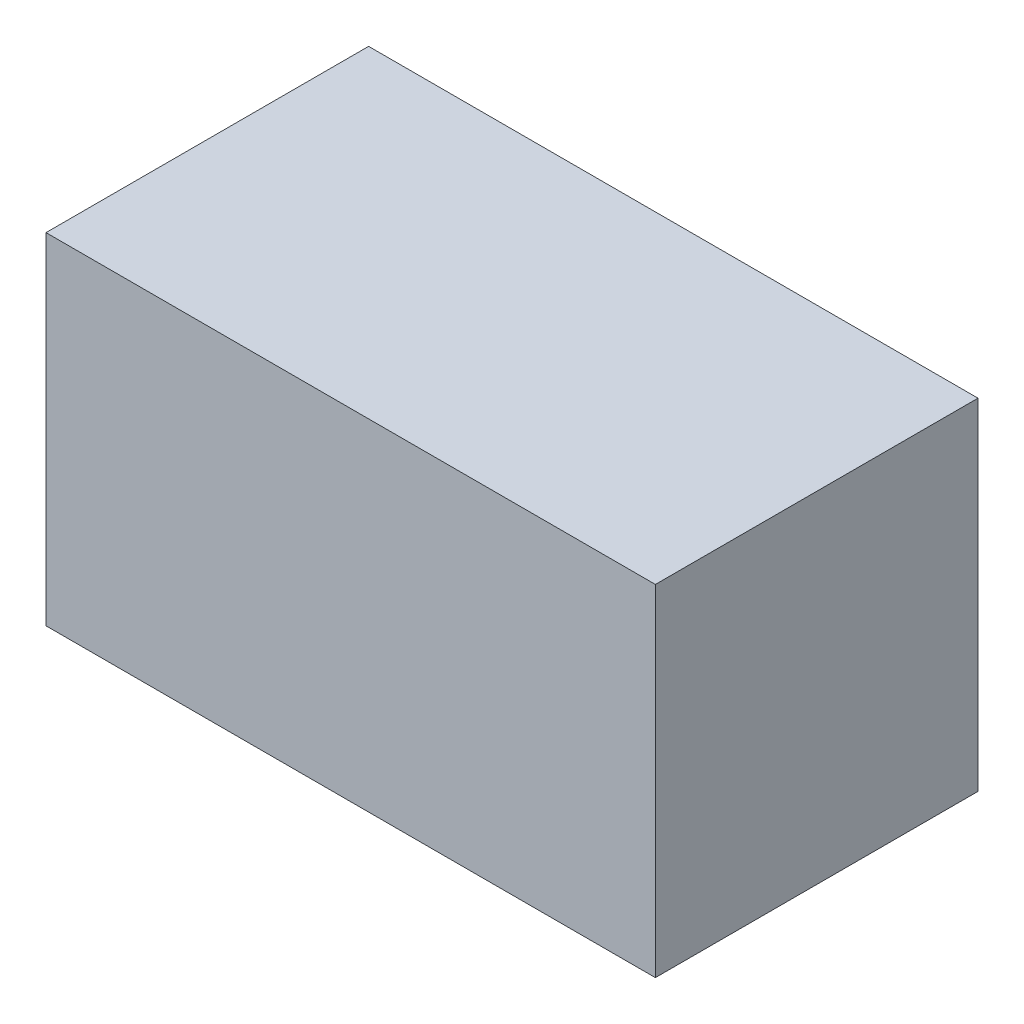
ISO-10303-21;
HEADER;
FILE_DESCRIPTION(('STEP AP214'),'2;1');
FILE_NAME('part.step','',(''),(''),'','','');
FILE_SCHEMA(('AUTOMOTIVE_DESIGN { 1 0 10303 214 1 1 1 1 }'));
ENDSEC;
DATA;
#1=APPLICATION_CONTEXT('core data for automotive mechanical design processes');
#2=APPLICATION_PROTOCOL_DEFINITION('international standard','automotive_design',2000,#1);
#3=PRODUCT_CONTEXT('',#1,'mechanical');
#4=PRODUCT('Part','Part','',(#3));
#5=PRODUCT_RELATED_PRODUCT_CATEGORY('part','',(#4));
#6=PRODUCT_DEFINITION_FORMATION('','',#4);
#7=PRODUCT_DEFINITION_CONTEXT('part definition',#1,'design');
#8=PRODUCT_DEFINITION('design','',#6,#7);
#9=PRODUCT_DEFINITION_SHAPE('','',#8);
#10=(LENGTH_UNIT() NAMED_UNIT(*) SI_UNIT(.MILLI.,.METRE.));
#11=(NAMED_UNIT(*) PLANE_ANGLE_UNIT() SI_UNIT($,.RADIAN.));
#12=(NAMED_UNIT(*) SI_UNIT($,.STERADIAN.) SOLID_ANGLE_UNIT());
#13=UNCERTAINTY_MEASURE_WITH_UNIT(LENGTH_MEASURE(1.E-05),#10,'distance_accuracy_value','');
#14=(GEOMETRIC_REPRESENTATION_CONTEXT(3) GLOBAL_UNCERTAINTY_ASSIGNED_CONTEXT((#13)) GLOBAL_UNIT_ASSIGNED_CONTEXT((#10,
#11,#12)) REPRESENTATION_CONTEXT('',''));
#15=CARTESIAN_POINT('',(0.,0.,0.));
#16=DIRECTION('',(0.,0.,1.));
#17=DIRECTION('',(1.,0.,0.));
#18=AXIS2_PLACEMENT_3D('',#15,#16,#17);
#19=CARTESIAN_POINT('',(-0.85000084,-0.47500032,0.90000074));
#20=DIRECTION('',(0.,0.,-1.));
#21=DIRECTION('',(-1.,0.,0.));
#22=AXIS2_PLACEMENT_3D('',#19,#20,#21);
#23=PLANE('',#22);
#24=DIRECTION('',(0.,1.,0.));
#25=VECTOR('',#24,1.);
#26=CARTESIAN_POINT('',(0.85000084,-0.47500032,0.90000074));
#27=LINE('',#26,#25);
#28=CARTESIAN_POINT('',(0.85000084,-0.47500032,0.90000074));
#29=VERTEX_POINT('',#28);
#30=CARTESIAN_POINT('',(0.85000084,0.47500032,0.90000074));
#31=VERTEX_POINT('',#30);
#32=EDGE_CURVE('E54',#29,#31,#27,.T.);
#33=ORIENTED_EDGE('',*,*,#32,.T.);
#34=DIRECTION('',(1.,0.,0.));
#35=VECTOR('',#34,1.);
#36=CARTESIAN_POINT('',(0.85000084,0.47500032,0.90000074));
#37=LINE('',#36,#35);
#38=CARTESIAN_POINT('',(-0.85000084,0.47500032,0.90000074));
#39=VERTEX_POINT('',#38);
#40=EDGE_CURVE('E56',#31,#39,#37,.F.);
#41=ORIENTED_EDGE('',*,*,#40,.T.);
#42=DIRECTION('',(0.,1.,0.));
#43=VECTOR('',#42,1.);
#44=CARTESIAN_POINT('',(-0.85000084,0.47500032,0.90000074));
#45=LINE('',#44,#43);
#46=CARTESIAN_POINT('',(-0.85000084,-0.47500032,0.90000074));
#47=VERTEX_POINT('',#46);
#48=EDGE_CURVE('E19',#39,#47,#45,.F.);
#49=ORIENTED_EDGE('',*,*,#48,.T.);
#50=DIRECTION('',(1.,0.,0.));
#51=VECTOR('',#50,1.);
#52=CARTESIAN_POINT('',(-0.85000084,-0.47500032,0.90000074));
#53=LINE('',#52,#51);
#54=EDGE_CURVE('E79',#47,#29,#53,.T.);
#55=ORIENTED_EDGE('',*,*,#54,.T.);
#56=EDGE_LOOP('',(#33,#41,#49,#55));
#57=FACE_BOUND('',#56,.T.);
#58=ADVANCED_FACE('F16',(#57),#23,.F.);
#59=CARTESIAN_POINT('',(-0.85000084,0.47500032,0.));
#60=DIRECTION('',(1.,0.,0.));
#61=DIRECTION('',(0.,0.,-1.));
#62=AXIS2_PLACEMENT_3D('',#59,#60,#61);
#63=PLANE('',#62);
#64=DIRECTION('',(0.,0.,1.));
#65=VECTOR('',#64,1.);
#66=CARTESIAN_POINT('',(-0.85000084,-0.47500032,0.));
#67=LINE('',#66,#65);
#68=CARTESIAN_POINT('',(-0.85000084,-0.47500032,0.));
#69=VERTEX_POINT('',#68);
#70=EDGE_CURVE('E67',#69,#47,#67,.T.);
#71=ORIENTED_EDGE('',*,*,#70,.T.);
#72=ORIENTED_EDGE('',*,*,#48,.F.);
#73=DIRECTION('',(0.,0.,-1.));
#74=VECTOR('',#73,1.);
#75=CARTESIAN_POINT('',(-0.85000084,0.47500032,0.));
#76=LINE('',#75,#74);
#77=CARTESIAN_POINT('',(-0.85000084,0.47500032,0.));
#78=VERTEX_POINT('',#77);
#79=EDGE_CURVE('E62',#39,#78,#76,.T.);
#80=ORIENTED_EDGE('',*,*,#79,.T.);
#81=DIRECTION('',(0.,1.,0.));
#82=VECTOR('',#81,1.);
#83=CARTESIAN_POINT('',(-0.85000084,-0.47500032,0.));
#84=LINE('',#83,#82);
#85=EDGE_CURVE('E82',#69,#78,#84,.T.);
#86=ORIENTED_EDGE('',*,*,#85,.F.);
#87=EDGE_LOOP('',(#71,#72,#80,#86));
#88=FACE_BOUND('',#87,.T.);
#89=ADVANCED_FACE('F64',(#88),#63,.F.);
#90=CARTESIAN_POINT('',(0.85000084,0.47500032,0.));
#91=DIRECTION('',(0.,-1.,0.));
#92=DIRECTION('',(0.,0.,-1.));
#93=AXIS2_PLACEMENT_3D('',#90,#91,#92);
#94=PLANE('',#93);
#95=ORIENTED_EDGE('',*,*,#79,.F.);
#96=ORIENTED_EDGE('',*,*,#40,.F.);
#97=DIRECTION('',(0.,0.,1.));
#98=VECTOR('',#97,1.);
#99=CARTESIAN_POINT('',(0.85000084,0.47500032,0.));
#100=LINE('',#99,#98);
#101=CARTESIAN_POINT('',(0.85000084,0.47500032,0.));
#102=VERTEX_POINT('',#101);
#103=EDGE_CURVE('E74',#31,#102,#100,.F.);
#104=ORIENTED_EDGE('',*,*,#103,.T.);
#105=DIRECTION('',(-1.,0.,0.));
#106=VECTOR('',#105,1.);
#107=CARTESIAN_POINT('',(-0.85000084,0.47500032,0.));
#108=LINE('',#107,#106);
#109=EDGE_CURVE('E71',#78,#102,#108,.F.);
#110=ORIENTED_EDGE('',*,*,#109,.F.);
#111=EDGE_LOOP('',(#95,#96,#104,#110));
#112=FACE_BOUND('',#111,.T.);
#113=ADVANCED_FACE('F69',(#112),#94,.F.);
#114=CARTESIAN_POINT('',(0.85000084,-0.47500032,0.));
#115=DIRECTION('',(-1.,0.,0.));
#116=DIRECTION('',(0.,0.,1.));
#117=AXIS2_PLACEMENT_3D('',#114,#115,#116);
#118=PLANE('',#117);
#119=ORIENTED_EDGE('',*,*,#103,.F.);
#120=ORIENTED_EDGE('',*,*,#32,.F.);
#121=DIRECTION('',(0.,0.,1.));
#122=VECTOR('',#121,1.);
#123=CARTESIAN_POINT('',(0.85000084,-0.47500032,0.));
#124=LINE('',#123,#122);
#125=CARTESIAN_POINT('',(0.85000084,-0.47500032,0.));
#126=VERTEX_POINT('',#125);
#127=EDGE_CURVE('E34',#29,#126,#124,.F.);
#128=ORIENTED_EDGE('',*,*,#127,.T.);
#129=DIRECTION('',(0.,1.,0.));
#130=VECTOR('',#129,1.);
#131=CARTESIAN_POINT('',(0.85000084,-0.47500032,0.));
#132=LINE('',#131,#130);
#133=EDGE_CURVE('E25',#102,#126,#132,.F.);
#134=ORIENTED_EDGE('',*,*,#133,.F.);
#135=EDGE_LOOP('',(#119,#120,#128,#134));
#136=FACE_BOUND('',#135,.T.);
#137=ADVANCED_FACE('F88',(#136),#118,.F.);
#138=CARTESIAN_POINT('',(-0.85000084,-0.47500032,0.));
#139=DIRECTION('',(0.,1.,0.));
#140=DIRECTION('',(0.,0.,1.));
#141=AXIS2_PLACEMENT_3D('',#138,#139,#140);
#142=PLANE('',#141);
#143=ORIENTED_EDGE('',*,*,#127,.F.);
#144=ORIENTED_EDGE('',*,*,#54,.F.);
#145=ORIENTED_EDGE('',*,*,#70,.F.);
#146=DIRECTION('',(-1.,0.,0.));
#147=VECTOR('',#146,1.);
#148=CARTESIAN_POINT('',(-0.85000084,-0.47500032,0.));
#149=LINE('',#148,#147);
#150=EDGE_CURVE('E11',#126,#69,#149,.T.);
#151=ORIENTED_EDGE('',*,*,#150,.F.);
#152=EDGE_LOOP('',(#143,#144,#145,#151));
#153=FACE_BOUND('',#152,.T.);
#154=ADVANCED_FACE('F90',(#153),#142,.F.);
#155=CARTESIAN_POINT('',(-0.85000084,-0.47500032,0.));
#156=DIRECTION('',(0.,0.,-1.));
#157=DIRECTION('',(-1.,0.,0.));
#158=AXIS2_PLACEMENT_3D('',#155,#156,#157);
#159=PLANE('',#158);
#160=ORIENTED_EDGE('',*,*,#133,.T.);
#161=ORIENTED_EDGE('',*,*,#150,.T.);
#162=ORIENTED_EDGE('',*,*,#85,.T.);
#163=ORIENTED_EDGE('',*,*,#109,.T.);
#164=EDGE_LOOP('',(#160,#161,#162,#163));
#165=FACE_BOUND('',#164,.T.);
#166=ADVANCED_FACE('F87',(#165),#159,.T.);
#167=CLOSED_SHELL('',(#58,#89,#113,#137,#154,#166));
#168=MANIFOLD_SOLID_BREP('B1',#167);
#169=ADVANCED_BREP_SHAPE_REPRESENTATION('',(#18,#168),#14);
#170=SHAPE_DEFINITION_REPRESENTATION(#9,#169);
ENDSEC;
END-ISO-10303-21;
